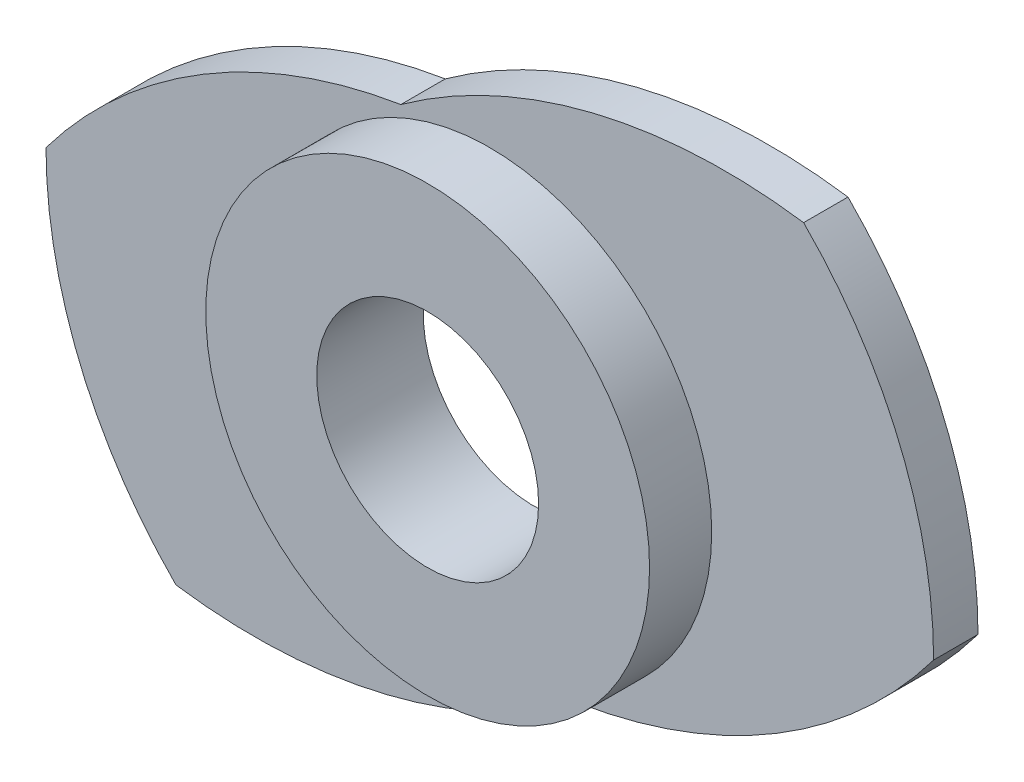
ISO-10303-21;
HEADER;
FILE_DESCRIPTION(('STEP AP214'),'2;1');
FILE_NAME('part.step','',(''),(''),'','','');
FILE_SCHEMA(('AUTOMOTIVE_DESIGN { 1 0 10303 214 1 1 1 1 }'));
ENDSEC;
DATA;
#1=APPLICATION_CONTEXT('core data for automotive mechanical design processes');
#2=APPLICATION_PROTOCOL_DEFINITION('international standard','automotive_design',2000,#1);
#3=PRODUCT_CONTEXT('',#1,'mechanical');
#4=PRODUCT('Part','Part','',(#3));
#5=PRODUCT_RELATED_PRODUCT_CATEGORY('part','',(#4));
#6=PRODUCT_DEFINITION_FORMATION('','',#4);
#7=PRODUCT_DEFINITION_CONTEXT('part definition',#1,'design');
#8=PRODUCT_DEFINITION('design','',#6,#7);
#9=PRODUCT_DEFINITION_SHAPE('','',#8);
#10=(LENGTH_UNIT() NAMED_UNIT(*) SI_UNIT(.MILLI.,.METRE.));
#11=(NAMED_UNIT(*) PLANE_ANGLE_UNIT() SI_UNIT($,.RADIAN.));
#12=(NAMED_UNIT(*) SI_UNIT($,.STERADIAN.) SOLID_ANGLE_UNIT());
#13=UNCERTAINTY_MEASURE_WITH_UNIT(LENGTH_MEASURE(1.E-05),#10,'distance_accuracy_value','');
#14=(GEOMETRIC_REPRESENTATION_CONTEXT(3) GLOBAL_UNCERTAINTY_ASSIGNED_CONTEXT((#13)) GLOBAL_UNIT_ASSIGNED_CONTEXT((#10,
#11,#12)) REPRESENTATION_CONTEXT('',''));
#15=CARTESIAN_POINT('',(0.,0.,0.));
#16=DIRECTION('',(0.,0.,1.));
#17=DIRECTION('',(1.,0.,0.));
#18=AXIS2_PLACEMENT_3D('',#15,#16,#17);
#19=CARTESIAN_POINT('',(5.30330085889912,-5.30330085889911,1.));
#20=DIRECTION('',(0.,0.,-1.));
#21=DIRECTION('',(-1.,0.,0.));
#22=AXIS2_PLACEMENT_3D('',#19,#20,#21);
#23=CYLINDRICAL_SURFACE('',#22,12.5);
#24=CARTESIAN_POINT('',(5.30330085889912,-5.30330085889911,0.));
#25=DIRECTION('',(0.,0.,1.));
#26=DIRECTION('',(1.,0.,0.));
#27=AXIS2_PLACEMENT_3D('',#24,#25,#26);
#28=CIRCLE('',#27,12.5);
#29=CARTESIAN_POINT('',(-2.00408914022922,4.838299182546,0.));
#30=VERTEX_POINT('',#29);
#31=CARTESIAN_POINT('',(7.07106781186547,7.07106781186548,0.));
#32=VERTEX_POINT('',#31);
#33=EDGE_CURVE('E126',#30,#32,#28,.F.);
#34=ORIENTED_EDGE('',*,*,#33,.F.);
#35=DIRECTION('',(0.,0.,-1.));
#36=VECTOR('',#35,1.);
#37=CARTESIAN_POINT('',(-2.00408914022922,4.838299182546,1.));
#38=LINE('',#37,#36);
#39=CARTESIAN_POINT('',(-2.00408914022922,4.838299182546,1.));
#40=VERTEX_POINT('',#39);
#41=EDGE_CURVE('E44',#40,#30,#38,.T.);
#42=ORIENTED_EDGE('',*,*,#41,.F.);
#43=CARTESIAN_POINT('',(5.30330085889912,-5.30330085889911,1.));
#44=DIRECTION('',(0.,0.,1.));
#45=DIRECTION('',(1.,0.,0.));
#46=AXIS2_PLACEMENT_3D('',#43,#44,#45);
#47=CIRCLE('',#46,12.5);
#48=CARTESIAN_POINT('',(7.07106781186547,7.07106781186548,1.));
#49=VERTEX_POINT('',#48);
#50=EDGE_CURVE('E140',#40,#49,#47,.F.);
#51=ORIENTED_EDGE('',*,*,#50,.T.);
#52=DIRECTION('',(0.,0.,-1.));
#53=VECTOR('',#52,1.);
#54=CARTESIAN_POINT('',(7.07106781186547,7.07106781186548,1.));
#55=LINE('',#54,#53);
#56=EDGE_CURVE('E58',#49,#32,#55,.T.);
#57=ORIENTED_EDGE('',*,*,#56,.T.);
#58=EDGE_LOOP('',(#34,#42,#51,#57));
#59=FACE_BOUND('',#58,.T.);
#60=ADVANCED_FACE('F41',(#59),#23,.T.);
#61=CARTESIAN_POINT('',(0.,-7.50000000000001,1.));
#62=DIRECTION('',(0.,0.,-1.));
#63=DIRECTION('',(-1.,0.,0.));
#64=AXIS2_PLACEMENT_3D('',#61,#62,#63);
#65=CYLINDRICAL_SURFACE('',#64,12.5);
#66=CARTESIAN_POINT('',(0.,-7.50000000000001,0.));
#67=DIRECTION('',(0.,0.,1.));
#68=DIRECTION('',(1.,0.,0.));
#69=AXIS2_PLACEMENT_3D('',#66,#67,#68);
#70=CIRCLE('',#69,12.5);
#71=CARTESIAN_POINT('',(-10.,0.,0.));
#72=VERTEX_POINT('',#71);
#73=EDGE_CURVE('E128',#30,#72,#70,.T.);
#74=ORIENTED_EDGE('',*,*,#73,.T.);
#75=DIRECTION('',(0.,0.,-1.));
#76=VECTOR('',#75,1.);
#77=CARTESIAN_POINT('',(-10.,0.,1.));
#78=LINE('',#77,#76);
#79=CARTESIAN_POINT('',(-10.,0.,1.));
#80=VERTEX_POINT('',#79);
#81=EDGE_CURVE('E143',#80,#72,#78,.T.);
#82=ORIENTED_EDGE('',*,*,#81,.F.);
#83=CARTESIAN_POINT('',(0.,-7.50000000000001,1.));
#84=DIRECTION('',(0.,0.,1.));
#85=DIRECTION('',(1.,0.,0.));
#86=AXIS2_PLACEMENT_3D('',#83,#84,#85);
#87=CIRCLE('',#86,12.5);
#88=EDGE_CURVE('E121',#40,#80,#87,.T.);
#89=ORIENTED_EDGE('',*,*,#88,.F.);
#90=ORIENTED_EDGE('',*,*,#41,.T.);
#91=EDGE_LOOP('',(#74,#82,#89,#90));
#92=FACE_BOUND('',#91,.T.);
#93=ADVANCED_FACE('F150',(#92),#65,.T.);
#94=CARTESIAN_POINT('',(0.,0.,1.));
#95=DIRECTION('',(0.,0.,-1.));
#96=DIRECTION('',(-1.,0.,0.));
#97=AXIS2_PLACEMENT_3D('',#94,#95,#96);
#98=CYLINDRICAL_SURFACE('',#97,10.);
#99=CARTESIAN_POINT('',(0.,0.,0.));
#100=DIRECTION('',(0.,0.,1.));
#101=DIRECTION('',(1.,0.,0.));
#102=AXIS2_PLACEMENT_3D('',#99,#100,#101);
#103=CIRCLE('',#102,10.);
#104=CARTESIAN_POINT('',(-7.07106781186546,-7.07106781186549,0.));
#105=VERTEX_POINT('',#104);
#106=EDGE_CURVE('E131',#72,#105,#103,.T.);
#107=ORIENTED_EDGE('',*,*,#106,.T.);
#108=DIRECTION('',(0.,0.,-1.));
#109=VECTOR('',#108,1.);
#110=CARTESIAN_POINT('',(-7.07106781186546,-7.07106781186549,1.));
#111=LINE('',#110,#109);
#112=CARTESIAN_POINT('',(-7.07106781186546,-7.07106781186549,1.));
#113=VERTEX_POINT('',#112);
#114=EDGE_CURVE('E107',#113,#105,#111,.T.);
#115=ORIENTED_EDGE('',*,*,#114,.F.);
#116=CARTESIAN_POINT('',(0.,0.,1.));
#117=DIRECTION('',(0.,0.,1.));
#118=DIRECTION('',(1.,0.,0.));
#119=AXIS2_PLACEMENT_3D('',#116,#117,#118);
#120=CIRCLE('',#119,10.);
#121=EDGE_CURVE('E118',#80,#113,#120,.T.);
#122=ORIENTED_EDGE('',*,*,#121,.F.);
#123=ORIENTED_EDGE('',*,*,#81,.T.);
#124=EDGE_LOOP('',(#107,#115,#122,#123));
#125=FACE_BOUND('',#124,.T.);
#126=ADVANCED_FACE('F157',(#125),#98,.T.);
#127=CARTESIAN_POINT('',(-5.30330085889914,5.30330085889917,1.));
#128=DIRECTION('',(0.,0.,-1.));
#129=DIRECTION('',(-1.,0.,0.));
#130=AXIS2_PLACEMENT_3D('',#127,#128,#129);
#131=CYLINDRICAL_SURFACE('',#130,12.5000000000001);
#132=CARTESIAN_POINT('',(-5.30330085889914,5.30330085889917,0.));
#133=DIRECTION('',(0.,0.,1.));
#134=DIRECTION('',(1.,0.,0.));
#135=AXIS2_PLACEMENT_3D('',#132,#133,#134);
#136=CIRCLE('',#135,12.5000000000001);
#137=CARTESIAN_POINT('',(2.00408914022922,-4.838299182546,0.));
#138=VERTEX_POINT('',#137);
#139=EDGE_CURVE('E104',#138,#105,#136,.F.);
#140=ORIENTED_EDGE('',*,*,#139,.F.);
#141=DIRECTION('',(0.,0.,-1.));
#142=VECTOR('',#141,1.);
#143=CARTESIAN_POINT('',(2.00408914022922,-4.838299182546,1.));
#144=LINE('',#143,#142);
#145=CARTESIAN_POINT('',(2.00408914022922,-4.838299182546,1.));
#146=VERTEX_POINT('',#145);
#147=EDGE_CURVE('E98',#146,#138,#144,.T.);
#148=ORIENTED_EDGE('',*,*,#147,.F.);
#149=CARTESIAN_POINT('',(-5.30330085889914,5.30330085889917,1.));
#150=DIRECTION('',(0.,0.,1.));
#151=DIRECTION('',(1.,0.,0.));
#152=AXIS2_PLACEMENT_3D('',#149,#150,#151);
#153=CIRCLE('',#152,12.5000000000001);
#154=EDGE_CURVE('E102',#146,#113,#153,.F.);
#155=ORIENTED_EDGE('',*,*,#154,.T.);
#156=ORIENTED_EDGE('',*,*,#114,.T.);
#157=EDGE_LOOP('',(#140,#148,#155,#156));
#158=FACE_BOUND('',#157,.T.);
#159=ADVANCED_FACE('F100',(#158),#131,.T.);
#160=CARTESIAN_POINT('',(0.,7.50000000000007,1.));
#161=DIRECTION('',(0.,0.,-1.));
#162=DIRECTION('',(-1.,0.,0.));
#163=AXIS2_PLACEMENT_3D('',#160,#161,#162);
#164=CYLINDRICAL_SURFACE('',#163,12.5000000000001);
#165=CARTESIAN_POINT('',(0.,7.50000000000007,0.));
#166=DIRECTION('',(0.,0.,1.));
#167=DIRECTION('',(1.,0.,0.));
#168=AXIS2_PLACEMENT_3D('',#165,#166,#167);
#169=CIRCLE('',#168,12.5000000000001);
#170=CARTESIAN_POINT('',(10.,0.,0.));
#171=VERTEX_POINT('',#170);
#172=EDGE_CURVE('E135',#138,#171,#169,.T.);
#173=ORIENTED_EDGE('',*,*,#172,.T.);
#174=DIRECTION('',(0.,0.,-1.));
#175=VECTOR('',#174,1.);
#176=CARTESIAN_POINT('',(10.,0.,1.));
#177=LINE('',#176,#175);
#178=CARTESIAN_POINT('',(10.,0.,1.));
#179=VERTEX_POINT('',#178);
#180=EDGE_CURVE('E79',#179,#171,#177,.T.);
#181=ORIENTED_EDGE('',*,*,#180,.F.);
#182=CARTESIAN_POINT('',(0.,7.50000000000007,1.));
#183=DIRECTION('',(0.,0.,1.));
#184=DIRECTION('',(1.,0.,0.));
#185=AXIS2_PLACEMENT_3D('',#182,#183,#184);
#186=CIRCLE('',#185,12.5000000000001);
#187=EDGE_CURVE('E109',#146,#179,#186,.T.);
#188=ORIENTED_EDGE('',*,*,#187,.F.);
#189=ORIENTED_EDGE('',*,*,#147,.T.);
#190=EDGE_LOOP('',(#173,#181,#188,#189));
#191=FACE_BOUND('',#190,.T.);
#192=ADVANCED_FACE('F110',(#191),#164,.T.);
#193=CARTESIAN_POINT('',(0.,0.,1.));
#194=DIRECTION('',(0.,0.,-1.));
#195=DIRECTION('',(-1.,0.,0.));
#196=AXIS2_PLACEMENT_3D('',#193,#194,#195);
#197=CYLINDRICAL_SURFACE('',#196,10.);
#198=CARTESIAN_POINT('',(0.,0.,0.));
#199=DIRECTION('',(0.,0.,1.));
#200=DIRECTION('',(1.,0.,0.));
#201=AXIS2_PLACEMENT_3D('',#198,#199,#200);
#202=CIRCLE('',#201,10.);
#203=EDGE_CURVE('E137',#32,#171,#202,.F.);
#204=ORIENTED_EDGE('',*,*,#203,.F.);
#205=ORIENTED_EDGE('',*,*,#56,.F.);
#206=CARTESIAN_POINT('',(0.,0.,1.));
#207=DIRECTION('',(0.,0.,1.));
#208=DIRECTION('',(1.,0.,0.));
#209=AXIS2_PLACEMENT_3D('',#206,#207,#208);
#210=CIRCLE('',#209,10.);
#211=EDGE_CURVE('E113',#49,#179,#210,.F.);
#212=ORIENTED_EDGE('',*,*,#211,.T.);
#213=ORIENTED_EDGE('',*,*,#180,.T.);
#214=EDGE_LOOP('',(#204,#205,#212,#213));
#215=FACE_BOUND('',#214,.T.);
#216=ADVANCED_FACE('F167',(#215),#197,.T.);
#217=CARTESIAN_POINT('',(0.,0.,1.));
#218=DIRECTION('',(0.,0.,1.));
#219=DIRECTION('',(1.,0.,0.));
#220=AXIS2_PLACEMENT_3D('',#217,#218,#219);
#221=PLANE('',#220);
#222=CARTESIAN_POINT('',(0.,0.,1.));
#223=DIRECTION('',(0.,0.,1.));
#224=DIRECTION('',(1.,0.,0.));
#225=AXIS2_PLACEMENT_3D('',#222,#223,#224);
#226=CIRCLE('',#225,5.);
#227=CARTESIAN_POINT('',(5.,0.,1.));
#228=VERTEX_POINT('',#227);
#229=EDGE_CURVE('E11',#228,#228,#226,.T.);
#230=ORIENTED_EDGE('',*,*,#229,.F.);
#231=EDGE_LOOP('',(#230));
#232=FACE_BOUND('',#231,.T.);
#233=ORIENTED_EDGE('',*,*,#50,.F.);
#234=ORIENTED_EDGE('',*,*,#88,.T.);
#235=ORIENTED_EDGE('',*,*,#121,.T.);
#236=ORIENTED_EDGE('',*,*,#154,.F.);
#237=ORIENTED_EDGE('',*,*,#187,.T.);
#238=ORIENTED_EDGE('',*,*,#211,.F.);
#239=EDGE_LOOP('',(#233,#234,#235,#236,#237,#238));
#240=FACE_BOUND('',#239,.T.);
#241=ADVANCED_FACE('F116',(#232,#240),#221,.T.);
#242=CARTESIAN_POINT('',(0.,0.,0.));
#243=DIRECTION('',(0.,0.,1.));
#244=DIRECTION('',(1.,0.,0.));
#245=AXIS2_PLACEMENT_3D('',#242,#243,#244);
#246=PLANE('',#245);
#247=CARTESIAN_POINT('',(0.,0.,0.));
#248=DIRECTION('',(0.,0.,1.));
#249=DIRECTION('',(1.,0.,0.));
#250=AXIS2_PLACEMENT_3D('',#247,#248,#249);
#251=CIRCLE('',#250,2.5);
#252=CARTESIAN_POINT('',(2.5,0.,0.));
#253=VERTEX_POINT('',#252);
#254=EDGE_CURVE('E195',#253,#253,#251,.T.);
#255=ORIENTED_EDGE('',*,*,#254,.T.);
#256=EDGE_LOOP('',(#255));
#257=FACE_BOUND('',#256,.T.);
#258=ORIENTED_EDGE('',*,*,#33,.T.);
#259=ORIENTED_EDGE('',*,*,#203,.T.);
#260=ORIENTED_EDGE('',*,*,#172,.F.);
#261=ORIENTED_EDGE('',*,*,#139,.T.);
#262=ORIENTED_EDGE('',*,*,#106,.F.);
#263=ORIENTED_EDGE('',*,*,#73,.F.);
#264=EDGE_LOOP('',(#258,#259,#260,#261,#262,#263));
#265=FACE_BOUND('',#264,.T.);
#266=ADVANCED_FACE('F152',(#257,#265),#246,.F.);
#267=CARTESIAN_POINT('',(0.,0.,2.4));
#268=DIRECTION('',(0.,0.,-1.));
#269=DIRECTION('',(-1.,0.,0.));
#270=AXIS2_PLACEMENT_3D('',#267,#268,#269);
#271=CYLINDRICAL_SURFACE('',#270,5.);
#272=CARTESIAN_POINT('',(0.,0.,2.4));
#273=DIRECTION('',(0.,0.,1.));
#274=DIRECTION('',(1.,0.,0.));
#275=AXIS2_PLACEMENT_3D('',#272,#273,#274);
#276=CIRCLE('',#275,5.);
#277=CARTESIAN_POINT('',(5.,0.,2.4));
#278=VERTEX_POINT('',#277);
#279=EDGE_CURVE('E129',#278,#278,#276,.T.);
#280=ORIENTED_EDGE('',*,*,#279,.F.);
#281=EDGE_LOOP('',(#280));
#282=FACE_BOUND('',#281,.T.);
#283=ORIENTED_EDGE('',*,*,#229,.T.);
#284=EDGE_LOOP('',(#283));
#285=FACE_BOUND('',#284,.T.);
#286=ADVANCED_FACE('F172',(#282,#285),#271,.T.);
#287=CARTESIAN_POINT('',(0.,0.,2.4));
#288=DIRECTION('',(0.,0.,1.));
#289=DIRECTION('',(1.,0.,0.));
#290=AXIS2_PLACEMENT_3D('',#287,#288,#289);
#291=PLANE('',#290);
#292=CARTESIAN_POINT('',(0.,0.,2.4));
#293=DIRECTION('',(0.,0.,1.));
#294=DIRECTION('',(1.,0.,0.));
#295=AXIS2_PLACEMENT_3D('',#292,#293,#294);
#296=CIRCLE('',#295,2.5);
#297=CARTESIAN_POINT('',(2.5,0.,2.4));
#298=VERTEX_POINT('',#297);
#299=EDGE_CURVE('E192',#298,#298,#296,.T.);
#300=ORIENTED_EDGE('',*,*,#299,.F.);
#301=EDGE_LOOP('',(#300));
#302=FACE_BOUND('',#301,.T.);
#303=ORIENTED_EDGE('',*,*,#279,.T.);
#304=EDGE_LOOP('',(#303));
#305=FACE_BOUND('',#304,.T.);
#306=ADVANCED_FACE('F179',(#302,#305),#291,.T.);
#307=CARTESIAN_POINT('',(0.,0.,-5.6));
#308=DIRECTION('',(0.,0.,1.));
#309=DIRECTION('',(1.,0.,0.));
#310=AXIS2_PLACEMENT_3D('',#307,#308,#309);
#311=CYLINDRICAL_SURFACE('',#310,2.5);
#312=ORIENTED_EDGE('',*,*,#299,.T.);
#313=EDGE_LOOP('',(#312));
#314=FACE_BOUND('',#313,.T.);
#315=ORIENTED_EDGE('',*,*,#254,.F.);
#316=EDGE_LOOP('',(#315));
#317=FACE_BOUND('',#316,.T.);
#318=ADVANCED_FACE('F183',(#314,#317),#311,.F.);
#319=CLOSED_SHELL('',(#60,#93,#126,#159,#192,#216,#241,#266,#286,#306,#318));
#320=MANIFOLD_SOLID_BREP('B2',#319);
#321=ADVANCED_BREP_SHAPE_REPRESENTATION('',(#18,#320),#14);
#322=SHAPE_DEFINITION_REPRESENTATION(#9,#321);
ENDSEC;
END-ISO-10303-21;
